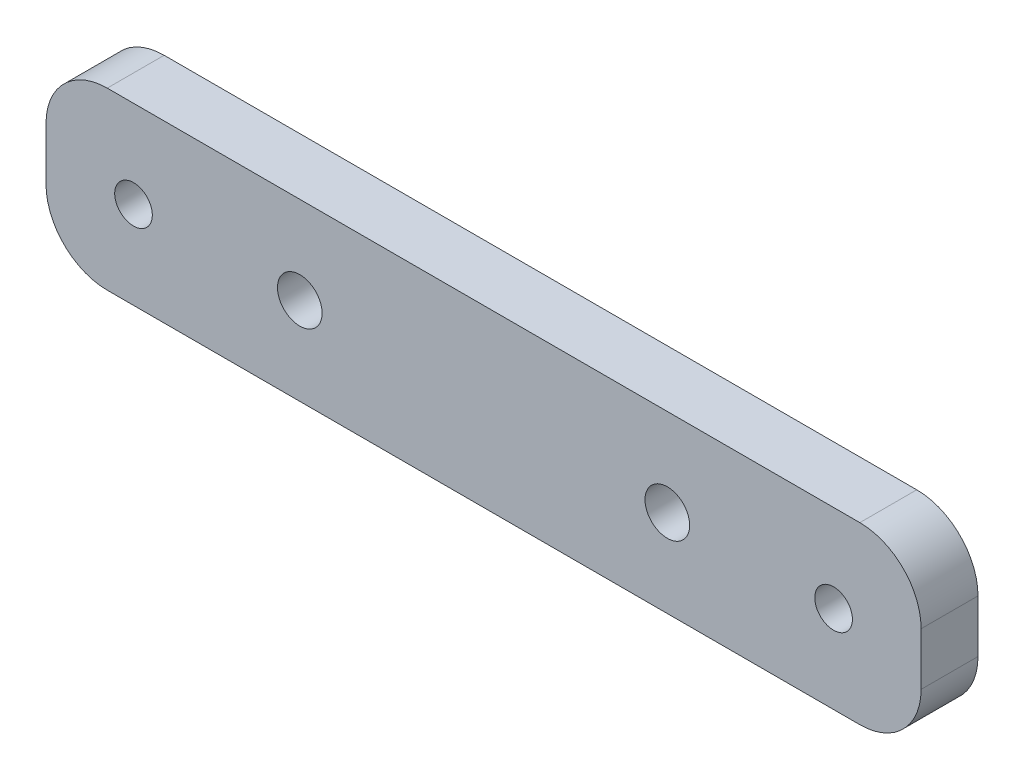
ISO-10303-21;
HEADER;
FILE_DESCRIPTION(('STEP AP214'),'2;1');
FILE_NAME('part.step','',(''),(''),'','','');
FILE_SCHEMA(('AUTOMOTIVE_DESIGN { 1 0 10303 214 1 1 1 1 }'));
ENDSEC;
DATA;
#1=APPLICATION_CONTEXT('core data for automotive mechanical design processes');
#2=APPLICATION_PROTOCOL_DEFINITION('international standard','automotive_design',2000,#1);
#3=PRODUCT_CONTEXT('',#1,'mechanical');
#4=PRODUCT('Part','Part','',(#3));
#5=PRODUCT_RELATED_PRODUCT_CATEGORY('part','',(#4));
#6=PRODUCT_DEFINITION_FORMATION('','',#4);
#7=PRODUCT_DEFINITION_CONTEXT('part definition',#1,'design');
#8=PRODUCT_DEFINITION('design','',#6,#7);
#9=PRODUCT_DEFINITION_SHAPE('','',#8);
#10=(LENGTH_UNIT() NAMED_UNIT(*) SI_UNIT(.MILLI.,.METRE.));
#11=(NAMED_UNIT(*) PLANE_ANGLE_UNIT() SI_UNIT($,.RADIAN.));
#12=(NAMED_UNIT(*) SI_UNIT($,.STERADIAN.) SOLID_ANGLE_UNIT());
#13=UNCERTAINTY_MEASURE_WITH_UNIT(LENGTH_MEASURE(1.E-05),#10,'distance_accuracy_value','');
#14=(GEOMETRIC_REPRESENTATION_CONTEXT(3) GLOBAL_UNCERTAINTY_ASSIGNED_CONTEXT((#13)) GLOBAL_UNIT_ASSIGNED_CONTEXT((#10,
#11,#12)) REPRESENTATION_CONTEXT('',''));
#15=CARTESIAN_POINT('',(0.,0.,0.));
#16=DIRECTION('',(0.,0.,1.));
#17=DIRECTION('',(1.,0.,0.));
#18=AXIS2_PLACEMENT_3D('',#15,#16,#17);
#19=CARTESIAN_POINT('',(0.,0.,6.5));
#20=DIRECTION('',(0.,0.,1.));
#21=DIRECTION('',(1.,0.,0.));
#22=AXIS2_PLACEMENT_3D('',#19,#20,#21);
#23=PLANE('',#22);
#24=CARTESIAN_POINT('',(71.,-10.,6.5));
#25=DIRECTION('',(0.,0.,1.));
#26=DIRECTION('',(-1.,0.,0.));
#27=AXIS2_PLACEMENT_3D('',#24,#25,#26);
#28=CIRCLE('',#27,2.54999999999999);
#29=CARTESIAN_POINT('',(68.45,-10.,6.5));
#30=VERTEX_POINT('',#29);
#31=EDGE_CURVE('E183',#30,#30,#28,.T.);
#32=ORIENTED_EDGE('',*,*,#31,.F.);
#33=EDGE_LOOP('',(#32));
#34=FACE_BOUND('',#33,.T.);
#35=CARTESIAN_POINT('',(10.,-10.,6.5));
#36=DIRECTION('',(0.,0.,1.));
#37=DIRECTION('',(1.,0.,0.));
#38=AXIS2_PLACEMENT_3D('',#35,#36,#37);
#39=CIRCLE('',#38,2.15);
#40=CARTESIAN_POINT('',(12.15,-10.,6.5));
#41=VERTEX_POINT('',#40);
#42=EDGE_CURVE('E166',#41,#41,#39,.T.);
#43=ORIENTED_EDGE('',*,*,#42,.F.);
#44=EDGE_LOOP('',(#43));
#45=FACE_BOUND('',#44,.T.);
#46=DIRECTION('',(0.,1.,0.));
#47=VECTOR('',#46,1.);
#48=CARTESIAN_POINT('',(100.,0.,6.5));
#49=LINE('',#48,#47);
#50=CARTESIAN_POINT('',(100.,-13.,6.5));
#51=VERTEX_POINT('',#50);
#52=CARTESIAN_POINT('',(100.,-7.,6.5));
#53=VERTEX_POINT('',#52);
#54=EDGE_CURVE('E173',#51,#53,#49,.T.);
#55=ORIENTED_EDGE('',*,*,#54,.T.);
#56=CARTESIAN_POINT('',(93.,-7.,6.5));
#57=DIRECTION('',(0.,0.,1.));
#58=DIRECTION('',(1.,0.,0.));
#59=AXIS2_PLACEMENT_3D('',#56,#57,#58);
#60=CIRCLE('',#59,7.);
#61=CARTESIAN_POINT('',(93.,0.,6.5));
#62=VERTEX_POINT('',#61);
#63=EDGE_CURVE('E150',#53,#62,#60,.T.);
#64=ORIENTED_EDGE('',*,*,#63,.T.);
#65=DIRECTION('',(-1.,0.,0.));
#66=VECTOR('',#65,1.);
#67=CARTESIAN_POINT('',(0.,0.,6.5));
#68=LINE('',#67,#66);
#69=CARTESIAN_POINT('',(7.,0.,6.5));
#70=VERTEX_POINT('',#69);
#71=EDGE_CURVE('E121',#62,#70,#68,.T.);
#72=ORIENTED_EDGE('',*,*,#71,.T.);
#73=CARTESIAN_POINT('',(7.,-7.,6.5));
#74=DIRECTION('',(0.,0.,1.));
#75=DIRECTION('',(1.,0.,0.));
#76=AXIS2_PLACEMENT_3D('',#73,#74,#75);
#77=CIRCLE('',#76,7.);
#78=CARTESIAN_POINT('',(0.,-7.,6.5));
#79=VERTEX_POINT('',#78);
#80=EDGE_CURVE('E145',#70,#79,#77,.T.);
#81=ORIENTED_EDGE('',*,*,#80,.T.);
#82=DIRECTION('',(0.,-1.,0.));
#83=VECTOR('',#82,1.);
#84=CARTESIAN_POINT('',(0.,0.,6.5));
#85=LINE('',#84,#83);
#86=CARTESIAN_POINT('',(0.,-13.,6.5));
#87=VERTEX_POINT('',#86);
#88=EDGE_CURVE('E128',#79,#87,#85,.T.);
#89=ORIENTED_EDGE('',*,*,#88,.T.);
#90=CARTESIAN_POINT('',(7.,-13.,6.5));
#91=DIRECTION('',(0.,0.,1.));
#92=DIRECTION('',(1.,0.,0.));
#93=AXIS2_PLACEMENT_3D('',#90,#91,#92);
#94=CIRCLE('',#93,7.);
#95=CARTESIAN_POINT('',(7.,-20.,6.5));
#96=VERTEX_POINT('',#95);
#97=EDGE_CURVE('E57',#87,#96,#94,.T.);
#98=ORIENTED_EDGE('',*,*,#97,.T.);
#99=DIRECTION('',(1.,0.,0.));
#100=VECTOR('',#99,1.);
#101=CARTESIAN_POINT('',(0.,-20.,6.5));
#102=LINE('',#101,#100);
#103=CARTESIAN_POINT('',(93.,-20.,6.5));
#104=VERTEX_POINT('',#103);
#105=EDGE_CURVE('E131',#96,#104,#102,.T.);
#106=ORIENTED_EDGE('',*,*,#105,.T.);
#107=CARTESIAN_POINT('',(93.,-13.,6.5));
#108=DIRECTION('',(0.,0.,1.));
#109=DIRECTION('',(1.,0.,0.));
#110=AXIS2_PLACEMENT_3D('',#107,#108,#109);
#111=CIRCLE('',#110,7.);
#112=EDGE_CURVE('E148',#104,#51,#111,.T.);
#113=ORIENTED_EDGE('',*,*,#112,.T.);
#114=EDGE_LOOP('',(#55,#64,#72,#81,#89,#98,#106,#113));
#115=FACE_BOUND('',#114,.T.);
#116=CARTESIAN_POINT('',(90.,-10.,6.5));
#117=DIRECTION('',(0.,0.,1.));
#118=DIRECTION('',(-1.,0.,0.));
#119=AXIS2_PLACEMENT_3D('',#116,#117,#118);
#120=CIRCLE('',#119,2.15);
#121=CARTESIAN_POINT('',(87.85,-10.,6.5));
#122=VERTEX_POINT('',#121);
#123=EDGE_CURVE('E178',#122,#122,#120,.T.);
#124=ORIENTED_EDGE('',*,*,#123,.F.);
#125=EDGE_LOOP('',(#124));
#126=FACE_BOUND('',#125,.T.);
#127=CARTESIAN_POINT('',(29.,-10.,6.5));
#128=DIRECTION('',(0.,0.,1.));
#129=DIRECTION('',(1.,0.,0.));
#130=AXIS2_PLACEMENT_3D('',#127,#128,#129);
#131=CIRCLE('',#130,2.55);
#132=CARTESIAN_POINT('',(31.55,-10.,6.5));
#133=VERTEX_POINT('',#132);
#134=EDGE_CURVE('E189',#133,#133,#131,.T.);
#135=ORIENTED_EDGE('',*,*,#134,.F.);
#136=EDGE_LOOP('',(#135));
#137=FACE_BOUND('',#136,.T.);
#138=ADVANCED_FACE('F35',(#34,#45,#115,#126,#137),#23,.T.);
#139=CARTESIAN_POINT('',(0.,0.,0.));
#140=DIRECTION('',(0.,0.,1.));
#141=DIRECTION('',(1.,0.,0.));
#142=AXIS2_PLACEMENT_3D('',#139,#140,#141);
#143=PLANE('',#142);
#144=DIRECTION('',(-1.,0.,0.));
#145=VECTOR('',#144,1.);
#146=CARTESIAN_POINT('',(0.,0.,0.));
#147=LINE('',#146,#145);
#148=CARTESIAN_POINT('',(93.,0.,0.));
#149=VERTEX_POINT('',#148);
#150=CARTESIAN_POINT('',(7.,0.,0.));
#151=VERTEX_POINT('',#150);
#152=EDGE_CURVE('E118',#149,#151,#147,.T.);
#153=ORIENTED_EDGE('',*,*,#152,.F.);
#154=CARTESIAN_POINT('',(93.,-7.,0.));
#155=DIRECTION('',(0.,0.,1.));
#156=DIRECTION('',(1.,0.,0.));
#157=AXIS2_PLACEMENT_3D('',#154,#155,#156);
#158=CIRCLE('',#157,7.);
#159=CARTESIAN_POINT('',(100.,-7.,0.));
#160=VERTEX_POINT('',#159);
#161=EDGE_CURVE('E101',#149,#160,#158,.F.);
#162=ORIENTED_EDGE('',*,*,#161,.T.);
#163=DIRECTION('',(0.,1.,0.));
#164=VECTOR('',#163,1.);
#165=CARTESIAN_POINT('',(100.,0.,0.));
#166=LINE('',#165,#164);
#167=CARTESIAN_POINT('',(100.,-13.,0.));
#168=VERTEX_POINT('',#167);
#169=EDGE_CURVE('E129',#168,#160,#166,.T.);
#170=ORIENTED_EDGE('',*,*,#169,.F.);
#171=CARTESIAN_POINT('',(93.,-13.,0.));
#172=DIRECTION('',(0.,0.,1.));
#173=DIRECTION('',(1.,0.,0.));
#174=AXIS2_PLACEMENT_3D('',#171,#172,#173);
#175=CIRCLE('',#174,7.);
#176=CARTESIAN_POINT('',(93.,-20.,0.));
#177=VERTEX_POINT('',#176);
#178=EDGE_CURVE('E112',#168,#177,#175,.F.);
#179=ORIENTED_EDGE('',*,*,#178,.T.);
#180=DIRECTION('',(1.,0.,0.));
#181=VECTOR('',#180,1.);
#182=CARTESIAN_POINT('',(0.,-20.,0.));
#183=LINE('',#182,#181);
#184=CARTESIAN_POINT('',(7.,-20.,0.));
#185=VERTEX_POINT('',#184);
#186=EDGE_CURVE('E133',#185,#177,#183,.T.);
#187=ORIENTED_EDGE('',*,*,#186,.F.);
#188=CARTESIAN_POINT('',(7.,-13.,0.));
#189=DIRECTION('',(0.,0.,1.));
#190=DIRECTION('',(1.,0.,0.));
#191=AXIS2_PLACEMENT_3D('',#188,#189,#190);
#192=CIRCLE('',#191,7.);
#193=CARTESIAN_POINT('',(0.,-13.,0.));
#194=VERTEX_POINT('',#193);
#195=EDGE_CURVE('E139',#185,#194,#192,.F.);
#196=ORIENTED_EDGE('',*,*,#195,.T.);
#197=DIRECTION('',(0.,-1.,0.));
#198=VECTOR('',#197,1.);
#199=CARTESIAN_POINT('',(0.,0.,0.));
#200=LINE('',#199,#198);
#201=CARTESIAN_POINT('',(0.,-7.,0.));
#202=VERTEX_POINT('',#201);
#203=EDGE_CURVE('E161',#202,#194,#200,.T.);
#204=ORIENTED_EDGE('',*,*,#203,.F.);
#205=CARTESIAN_POINT('',(7.,-7.,0.));
#206=DIRECTION('',(0.,0.,1.));
#207=DIRECTION('',(1.,0.,0.));
#208=AXIS2_PLACEMENT_3D('',#205,#206,#207);
#209=CIRCLE('',#208,7.);
#210=EDGE_CURVE('E122',#202,#151,#209,.F.);
#211=ORIENTED_EDGE('',*,*,#210,.T.);
#212=EDGE_LOOP('',(#153,#162,#170,#179,#187,#196,#204,#211));
#213=FACE_BOUND('',#212,.T.);
#214=CARTESIAN_POINT('',(10.,-10.,0.));
#215=DIRECTION('',(0.,0.,1.));
#216=DIRECTION('',(1.,0.,0.));
#217=AXIS2_PLACEMENT_3D('',#214,#215,#216);
#218=CIRCLE('',#217,2.15);
#219=CARTESIAN_POINT('',(12.15,-10.,0.));
#220=VERTEX_POINT('',#219);
#221=EDGE_CURVE('E169',#220,#220,#218,.T.);
#222=ORIENTED_EDGE('',*,*,#221,.T.);
#223=EDGE_LOOP('',(#222));
#224=FACE_BOUND('',#223,.T.);
#225=CARTESIAN_POINT('',(90.,-10.,0.));
#226=DIRECTION('',(0.,0.,1.));
#227=DIRECTION('',(-1.,0.,0.));
#228=AXIS2_PLACEMENT_3D('',#225,#226,#227);
#229=CIRCLE('',#228,2.15);
#230=CARTESIAN_POINT('',(87.85,-10.,0.));
#231=VERTEX_POINT('',#230);
#232=EDGE_CURVE('E180',#231,#231,#229,.T.);
#233=ORIENTED_EDGE('',*,*,#232,.T.);
#234=EDGE_LOOP('',(#233));
#235=FACE_BOUND('',#234,.T.);
#236=CARTESIAN_POINT('',(71.,-10.,0.));
#237=DIRECTION('',(0.,0.,1.));
#238=DIRECTION('',(-1.,0.,0.));
#239=AXIS2_PLACEMENT_3D('',#236,#237,#238);
#240=CIRCLE('',#239,2.54999999999999);
#241=CARTESIAN_POINT('',(68.45,-10.,0.));
#242=VERTEX_POINT('',#241);
#243=EDGE_CURVE('E186',#242,#242,#240,.T.);
#244=ORIENTED_EDGE('',*,*,#243,.T.);
#245=EDGE_LOOP('',(#244));
#246=FACE_BOUND('',#245,.T.);
#247=CARTESIAN_POINT('',(29.,-10.,0.));
#248=DIRECTION('',(0.,0.,1.));
#249=DIRECTION('',(1.,0.,0.));
#250=AXIS2_PLACEMENT_3D('',#247,#248,#249);
#251=CIRCLE('',#250,2.55);
#252=CARTESIAN_POINT('',(31.55,-10.,0.));
#253=VERTEX_POINT('',#252);
#254=EDGE_CURVE('E192',#253,#253,#251,.T.);
#255=ORIENTED_EDGE('',*,*,#254,.T.);
#256=EDGE_LOOP('',(#255));
#257=FACE_BOUND('',#256,.T.);
#258=ADVANCED_FACE('F125',(#213,#224,#235,#246,#257),#143,.F.);
#259=CARTESIAN_POINT('',(0.,0.,6.5));
#260=DIRECTION('',(1.,0.,0.));
#261=DIRECTION('',(0.,1.,0.));
#262=AXIS2_PLACEMENT_3D('',#259,#260,#261);
#263=PLANE('',#262);
#264=ORIENTED_EDGE('',*,*,#203,.T.);
#265=DIRECTION('',(0.,0.,-1.));
#266=VECTOR('',#265,1.);
#267=CARTESIAN_POINT('',(0.,-13.,6.5));
#268=LINE('',#267,#266);
#269=EDGE_CURVE('E11',#194,#87,#268,.F.);
#270=ORIENTED_EDGE('',*,*,#269,.T.);
#271=ORIENTED_EDGE('',*,*,#88,.F.);
#272=DIRECTION('',(0.,0.,-1.));
#273=VECTOR('',#272,1.);
#274=CARTESIAN_POINT('',(0.,-7.,6.5));
#275=LINE('',#274,#273);
#276=EDGE_CURVE('E43',#79,#202,#275,.T.);
#277=ORIENTED_EDGE('',*,*,#276,.T.);
#278=EDGE_LOOP('',(#264,#270,#271,#277));
#279=FACE_BOUND('',#278,.T.);
#280=ADVANCED_FACE('F160',(#279),#263,.F.);
#281=CARTESIAN_POINT('',(0.,-20.,6.5));
#282=DIRECTION('',(0.,1.,0.));
#283=DIRECTION('',(0.,0.,1.));
#284=AXIS2_PLACEMENT_3D('',#281,#282,#283);
#285=PLANE('',#284);
#286=ORIENTED_EDGE('',*,*,#186,.T.);
#287=DIRECTION('',(0.,0.,-1.));
#288=VECTOR('',#287,1.);
#289=CARTESIAN_POINT('',(93.,-20.,6.5));
#290=LINE('',#289,#288);
#291=EDGE_CURVE('E50',#177,#104,#290,.F.);
#292=ORIENTED_EDGE('',*,*,#291,.T.);
#293=ORIENTED_EDGE('',*,*,#105,.F.);
#294=DIRECTION('',(0.,0.,-1.));
#295=VECTOR('',#294,1.);
#296=CARTESIAN_POINT('',(7.,-20.,6.5));
#297=LINE('',#296,#295);
#298=EDGE_CURVE('E152',#96,#185,#297,.T.);
#299=ORIENTED_EDGE('',*,*,#298,.T.);
#300=EDGE_LOOP('',(#286,#292,#293,#299));
#301=FACE_BOUND('',#300,.T.);
#302=ADVANCED_FACE('F219',(#301),#285,.F.);
#303=CARTESIAN_POINT('',(100.,0.,6.5));
#304=DIRECTION('',(-1.,0.,0.));
#305=DIRECTION('',(0.,0.,1.));
#306=AXIS2_PLACEMENT_3D('',#303,#304,#305);
#307=PLANE('',#306);
#308=ORIENTED_EDGE('',*,*,#169,.T.);
#309=DIRECTION('',(0.,0.,-1.));
#310=VECTOR('',#309,1.);
#311=CARTESIAN_POINT('',(100.,-7.,6.5));
#312=LINE('',#311,#310);
#313=EDGE_CURVE('E106',#160,#53,#312,.F.);
#314=ORIENTED_EDGE('',*,*,#313,.T.);
#315=ORIENTED_EDGE('',*,*,#54,.F.);
#316=DIRECTION('',(0.,0.,-1.));
#317=VECTOR('',#316,1.);
#318=CARTESIAN_POINT('',(100.,-13.,6.5));
#319=LINE('',#318,#317);
#320=EDGE_CURVE('E111',#51,#168,#319,.T.);
#321=ORIENTED_EDGE('',*,*,#320,.T.);
#322=EDGE_LOOP('',(#308,#314,#315,#321));
#323=FACE_BOUND('',#322,.T.);
#324=ADVANCED_FACE('F216',(#323),#307,.F.);
#325=CARTESIAN_POINT('',(0.,0.,6.5));
#326=DIRECTION('',(0.,-1.,0.));
#327=DIRECTION('',(0.,0.,-1.));
#328=AXIS2_PLACEMENT_3D('',#325,#326,#327);
#329=PLANE('',#328);
#330=ORIENTED_EDGE('',*,*,#71,.F.);
#331=DIRECTION('',(0.,0.,-1.));
#332=VECTOR('',#331,1.);
#333=CARTESIAN_POINT('',(93.,0.,6.5));
#334=LINE('',#333,#332);
#335=EDGE_CURVE('E105',#62,#149,#334,.T.);
#336=ORIENTED_EDGE('',*,*,#335,.T.);
#337=ORIENTED_EDGE('',*,*,#152,.T.);
#338=DIRECTION('',(0.,0.,-1.));
#339=VECTOR('',#338,1.);
#340=CARTESIAN_POINT('',(7.,0.,6.5));
#341=LINE('',#340,#339);
#342=EDGE_CURVE('E123',#151,#70,#341,.F.);
#343=ORIENTED_EDGE('',*,*,#342,.T.);
#344=EDGE_LOOP('',(#330,#336,#337,#343));
#345=FACE_BOUND('',#344,.T.);
#346=ADVANCED_FACE('F117',(#345),#329,.F.);
#347=CARTESIAN_POINT('',(10.,-10.,6.5));
#348=DIRECTION('',(0.,0.,-1.));
#349=DIRECTION('',(-1.,0.,0.));
#350=AXIS2_PLACEMENT_3D('',#347,#348,#349);
#351=CYLINDRICAL_SURFACE('',#350,2.15);
#352=ORIENTED_EDGE('',*,*,#42,.T.);
#353=EDGE_LOOP('',(#352));
#354=FACE_BOUND('',#353,.T.);
#355=ORIENTED_EDGE('',*,*,#221,.F.);
#356=EDGE_LOOP('',(#355));
#357=FACE_BOUND('',#356,.T.);
#358=ADVANCED_FACE('F211',(#354,#357),#351,.F.);
#359=CARTESIAN_POINT('',(90.,-10.,6.5));
#360=DIRECTION('',(0.,0.,-1.));
#361=DIRECTION('',(-1.,0.,0.));
#362=AXIS2_PLACEMENT_3D('',#359,#360,#361);
#363=CYLINDRICAL_SURFACE('',#362,2.15);
#364=ORIENTED_EDGE('',*,*,#123,.T.);
#365=EDGE_LOOP('',(#364));
#366=FACE_BOUND('',#365,.T.);
#367=ORIENTED_EDGE('',*,*,#232,.F.);
#368=EDGE_LOOP('',(#367));
#369=FACE_BOUND('',#368,.T.);
#370=ADVANCED_FACE('F243',(#366,#369),#363,.F.);
#371=CARTESIAN_POINT('',(71.,-10.,6.5));
#372=DIRECTION('',(0.,0.,-1.));
#373=DIRECTION('',(-1.,0.,0.));
#374=AXIS2_PLACEMENT_3D('',#371,#372,#373);
#375=CYLINDRICAL_SURFACE('',#374,2.54999999999999);
#376=ORIENTED_EDGE('',*,*,#31,.T.);
#377=EDGE_LOOP('',(#376));
#378=FACE_BOUND('',#377,.T.);
#379=ORIENTED_EDGE('',*,*,#243,.F.);
#380=EDGE_LOOP('',(#379));
#381=FACE_BOUND('',#380,.T.);
#382=ADVANCED_FACE('F246',(#378,#381),#375,.F.);
#383=CARTESIAN_POINT('',(29.,-10.,6.5));
#384=DIRECTION('',(0.,0.,-1.));
#385=DIRECTION('',(-1.,0.,0.));
#386=AXIS2_PLACEMENT_3D('',#383,#384,#385);
#387=CYLINDRICAL_SURFACE('',#386,2.55);
#388=ORIENTED_EDGE('',*,*,#134,.T.);
#389=EDGE_LOOP('',(#388));
#390=FACE_BOUND('',#389,.T.);
#391=ORIENTED_EDGE('',*,*,#254,.F.);
#392=EDGE_LOOP('',(#391));
#393=FACE_BOUND('',#392,.T.);
#394=ADVANCED_FACE('F198',(#390,#393),#387,.F.);
#395=CARTESIAN_POINT('',(93.,-7.,6.5));
#396=DIRECTION('',(0.,0.,-1.));
#397=DIRECTION('',(-1.,0.,0.));
#398=AXIS2_PLACEMENT_3D('',#395,#396,#397);
#399=CYLINDRICAL_SURFACE('',#398,7.);
#400=ORIENTED_EDGE('',*,*,#63,.F.);
#401=ORIENTED_EDGE('',*,*,#313,.F.);
#402=ORIENTED_EDGE('',*,*,#161,.F.);
#403=ORIENTED_EDGE('',*,*,#335,.F.);
#404=EDGE_LOOP('',(#400,#401,#402,#403));
#405=FACE_BOUND('',#404,.T.);
#406=ADVANCED_FACE('F104',(#405),#399,.T.);
#407=CARTESIAN_POINT('',(93.,-13.,6.5));
#408=DIRECTION('',(0.,0.,-1.));
#409=DIRECTION('',(-1.,0.,0.));
#410=AXIS2_PLACEMENT_3D('',#407,#408,#409);
#411=CYLINDRICAL_SURFACE('',#410,7.);
#412=ORIENTED_EDGE('',*,*,#112,.F.);
#413=ORIENTED_EDGE('',*,*,#291,.F.);
#414=ORIENTED_EDGE('',*,*,#178,.F.);
#415=ORIENTED_EDGE('',*,*,#320,.F.);
#416=EDGE_LOOP('',(#412,#413,#414,#415));
#417=FACE_BOUND('',#416,.T.);
#418=ADVANCED_FACE('F227',(#417),#411,.T.);
#419=CARTESIAN_POINT('',(7.,-13.,6.5));
#420=DIRECTION('',(0.,0.,-1.));
#421=DIRECTION('',(-1.,0.,0.));
#422=AXIS2_PLACEMENT_3D('',#419,#420,#421);
#423=CYLINDRICAL_SURFACE('',#422,7.);
#424=ORIENTED_EDGE('',*,*,#97,.F.);
#425=ORIENTED_EDGE('',*,*,#269,.F.);
#426=ORIENTED_EDGE('',*,*,#195,.F.);
#427=ORIENTED_EDGE('',*,*,#298,.F.);
#428=EDGE_LOOP('',(#424,#425,#426,#427));
#429=FACE_BOUND('',#428,.T.);
#430=ADVANCED_FACE('F229',(#429),#423,.T.);
#431=CARTESIAN_POINT('',(7.,-7.,6.5));
#432=DIRECTION('',(0.,0.,-1.));
#433=DIRECTION('',(-1.,0.,0.));
#434=AXIS2_PLACEMENT_3D('',#431,#432,#433);
#435=CYLINDRICAL_SURFACE('',#434,7.);
#436=ORIENTED_EDGE('',*,*,#80,.F.);
#437=ORIENTED_EDGE('',*,*,#342,.F.);
#438=ORIENTED_EDGE('',*,*,#210,.F.);
#439=ORIENTED_EDGE('',*,*,#276,.F.);
#440=EDGE_LOOP('',(#436,#437,#438,#439));
#441=FACE_BOUND('',#440,.T.);
#442=ADVANCED_FACE('F37',(#441),#435,.T.);
#443=CLOSED_SHELL('',(#138,#258,#280,#302,#324,#346,#358,#370,#382,#394,#406,#418,#430,#442));
#444=MANIFOLD_SOLID_BREP('B2',#443);
#445=ADVANCED_BREP_SHAPE_REPRESENTATION('',(#18,#444),#14);
#446=SHAPE_DEFINITION_REPRESENTATION(#9,#445);
ENDSEC;
END-ISO-10303-21;
